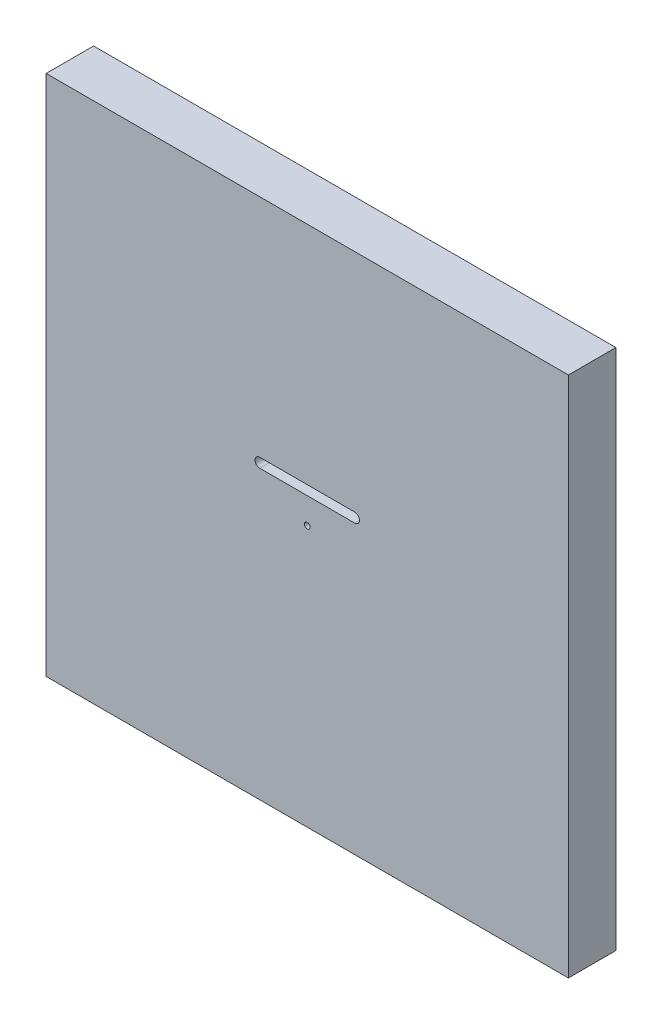
ISO-10303-21;
HEADER;
FILE_DESCRIPTION(('STEP AP214'),'2;1');
FILE_NAME('part.step','',(''),(''),'','','');
FILE_SCHEMA(('AUTOMOTIVE_DESIGN { 1 0 10303 214 1 1 1 1 }'));
ENDSEC;
DATA;
#1=APPLICATION_CONTEXT('core data for automotive mechanical design processes');
#2=APPLICATION_PROTOCOL_DEFINITION('international standard','automotive_design',2000,#1);
#3=PRODUCT_CONTEXT('',#1,'mechanical');
#4=PRODUCT('Part','Part','',(#3));
#5=PRODUCT_RELATED_PRODUCT_CATEGORY('part','',(#4));
#6=PRODUCT_DEFINITION_FORMATION('','',#4);
#7=PRODUCT_DEFINITION_CONTEXT('part definition',#1,'design');
#8=PRODUCT_DEFINITION('design','',#6,#7);
#9=PRODUCT_DEFINITION_SHAPE('','',#8);
#10=(LENGTH_UNIT() NAMED_UNIT(*) SI_UNIT(.MILLI.,.METRE.));
#11=(NAMED_UNIT(*) PLANE_ANGLE_UNIT() SI_UNIT($,.RADIAN.));
#12=(NAMED_UNIT(*) SI_UNIT($,.STERADIAN.) SOLID_ANGLE_UNIT());
#13=UNCERTAINTY_MEASURE_WITH_UNIT(LENGTH_MEASURE(1.E-05),#10,'distance_accuracy_value','');
#14=(GEOMETRIC_REPRESENTATION_CONTEXT(3) GLOBAL_UNCERTAINTY_ASSIGNED_CONTEXT((#13)) GLOBAL_UNIT_ASSIGNED_CONTEXT((#10,
#11,#12)) REPRESENTATION_CONTEXT('',''));
#15=CARTESIAN_POINT('',(0.,0.,0.));
#16=DIRECTION('',(0.,0.,1.));
#17=DIRECTION('',(1.,0.,0.));
#18=AXIS2_PLACEMENT_3D('',#15,#16,#17);
#19=CARTESIAN_POINT('',(-234.011279982949,178.585657370518,50.));
#20=DIRECTION('',(1.,0.,0.));
#21=DIRECTION('',(0.,1.,0.));
#22=AXIS2_PLACEMENT_3D('',#19,#20,#21);
#23=PLANE('',#22);
#24=DIRECTION('',(0.,-1.,0.));
#25=VECTOR('',#24,1.);
#26=CARTESIAN_POINT('',(-234.011279982949,178.585657370518,0.));
#27=LINE('',#26,#25);
#28=CARTESIAN_POINT('',(-234.011279982949,178.585657370518,0.));
#29=VERTEX_POINT('',#28);
#30=CARTESIAN_POINT('',(-234.011279982949,-371.414342629482,0.));
#31=VERTEX_POINT('',#30);
#32=EDGE_CURVE('E131',#29,#31,#27,.T.);
#33=ORIENTED_EDGE('',*,*,#32,.T.);
#34=DIRECTION('',(0.,0.,-1.));
#35=VECTOR('',#34,1.);
#36=CARTESIAN_POINT('',(-234.011279982949,-371.414342629482,50.));
#37=LINE('',#36,#35);
#38=CARTESIAN_POINT('',(-234.011279982949,-371.414342629482,50.));
#39=VERTEX_POINT('',#38);
#40=EDGE_CURVE('E11',#39,#31,#37,.T.);
#41=ORIENTED_EDGE('',*,*,#40,.F.);
#42=DIRECTION('',(0.,-1.,0.));
#43=VECTOR('',#42,1.);
#44=CARTESIAN_POINT('',(-234.011279982949,178.585657370518,50.));
#45=LINE('',#44,#43);
#46=CARTESIAN_POINT('',(-234.011279982949,178.585657370518,50.));
#47=VERTEX_POINT('',#46);
#48=EDGE_CURVE('E140',#47,#39,#45,.T.);
#49=ORIENTED_EDGE('',*,*,#48,.F.);
#50=DIRECTION('',(0.,0.,-1.));
#51=VECTOR('',#50,1.);
#52=CARTESIAN_POINT('',(-234.011279982949,178.585657370518,50.));
#53=LINE('',#52,#51);
#54=EDGE_CURVE('E150',#47,#29,#53,.T.);
#55=ORIENTED_EDGE('',*,*,#54,.T.);
#56=EDGE_LOOP('',(#33,#41,#49,#55));
#57=FACE_BOUND('',#56,.T.);
#58=ADVANCED_FACE('F33',(#57),#23,.F.);
#59=CARTESIAN_POINT('',(-234.011279982949,-371.414342629482,50.));
#60=DIRECTION('',(0.,1.,0.));
#61=DIRECTION('',(0.,0.,1.));
#62=AXIS2_PLACEMENT_3D('',#59,#60,#61);
#63=PLANE('',#62);
#64=DIRECTION('',(1.,0.,0.));
#65=VECTOR('',#64,1.);
#66=CARTESIAN_POINT('',(-234.011279982949,-371.414342629482,0.));
#67=LINE('',#66,#65);
#68=CARTESIAN_POINT('',(315.988720017051,-371.414342629482,0.));
#69=VERTEX_POINT('',#68);
#70=EDGE_CURVE('E153',#31,#69,#67,.T.);
#71=ORIENTED_EDGE('',*,*,#70,.T.);
#72=DIRECTION('',(0.,0.,-1.));
#73=VECTOR('',#72,1.);
#74=CARTESIAN_POINT('',(315.988720017051,-371.414342629482,50.));
#75=LINE('',#74,#73);
#76=CARTESIAN_POINT('',(315.988720017051,-371.414342629482,50.));
#77=VERTEX_POINT('',#76);
#78=EDGE_CURVE('E40',#77,#69,#75,.T.);
#79=ORIENTED_EDGE('',*,*,#78,.F.);
#80=DIRECTION('',(1.,0.,0.));
#81=VECTOR('',#80,1.);
#82=CARTESIAN_POINT('',(-234.011279982949,-371.414342629482,50.));
#83=LINE('',#82,#81);
#84=EDGE_CURVE('E143',#39,#77,#83,.T.);
#85=ORIENTED_EDGE('',*,*,#84,.F.);
#86=ORIENTED_EDGE('',*,*,#40,.T.);
#87=EDGE_LOOP('',(#71,#79,#85,#86));
#88=FACE_BOUND('',#87,.T.);
#89=ADVANCED_FACE('F182',(#88),#63,.F.);
#90=CARTESIAN_POINT('',(315.988720017051,178.585657370518,50.));
#91=DIRECTION('',(-1.,0.,0.));
#92=DIRECTION('',(0.,-1.,0.));
#93=AXIS2_PLACEMENT_3D('',#90,#91,#92);
#94=PLANE('',#93);
#95=DIRECTION('',(0.,1.,0.));
#96=VECTOR('',#95,1.);
#97=CARTESIAN_POINT('',(315.988720017051,178.585657370518,0.));
#98=LINE('',#97,#96);
#99=CARTESIAN_POINT('',(315.988720017051,178.585657370518,0.));
#100=VERTEX_POINT('',#99);
#101=EDGE_CURVE('E155',#69,#100,#98,.T.);
#102=ORIENTED_EDGE('',*,*,#101,.T.);
#103=DIRECTION('',(0.,0.,-1.));
#104=VECTOR('',#103,1.);
#105=CARTESIAN_POINT('',(315.988720017051,178.585657370518,50.));
#106=LINE('',#105,#104);
#107=CARTESIAN_POINT('',(315.988720017051,178.585657370518,50.));
#108=VERTEX_POINT('',#107);
#109=EDGE_CURVE('E160',#108,#100,#106,.T.);
#110=ORIENTED_EDGE('',*,*,#109,.F.);
#111=DIRECTION('',(0.,1.,0.));
#112=VECTOR('',#111,1.);
#113=CARTESIAN_POINT('',(315.988720017051,178.585657370518,50.));
#114=LINE('',#113,#112);
#115=EDGE_CURVE('E146',#77,#108,#114,.T.);
#116=ORIENTED_EDGE('',*,*,#115,.F.);
#117=ORIENTED_EDGE('',*,*,#78,.T.);
#118=EDGE_LOOP('',(#102,#110,#116,#117));
#119=FACE_BOUND('',#118,.T.);
#120=ADVANCED_FACE('F167',(#119),#94,.F.);
#121=CARTESIAN_POINT('',(-234.011279982949,178.585657370518,50.));
#122=DIRECTION('',(0.,-1.,0.));
#123=DIRECTION('',(0.,0.,-1.));
#124=AXIS2_PLACEMENT_3D('',#121,#122,#123);
#125=PLANE('',#124);
#126=DIRECTION('',(-1.,0.,0.));
#127=VECTOR('',#126,1.);
#128=CARTESIAN_POINT('',(-234.011279982949,178.585657370518,0.));
#129=LINE('',#128,#127);
#130=EDGE_CURVE('E144',#100,#29,#129,.T.);
#131=ORIENTED_EDGE('',*,*,#130,.T.);
#132=ORIENTED_EDGE('',*,*,#54,.F.);
#133=DIRECTION('',(-1.,0.,0.));
#134=VECTOR('',#133,1.);
#135=CARTESIAN_POINT('',(-234.011279982949,178.585657370518,50.));
#136=LINE('',#135,#134);
#137=EDGE_CURVE('E148',#108,#47,#136,.T.);
#138=ORIENTED_EDGE('',*,*,#137,.F.);
#139=ORIENTED_EDGE('',*,*,#109,.T.);
#140=EDGE_LOOP('',(#131,#132,#138,#139));
#141=FACE_BOUND('',#140,.T.);
#142=ADVANCED_FACE('F176',(#141),#125,.F.);
#143=CARTESIAN_POINT('',(0.,0.,50.));
#144=DIRECTION('',(0.,0.,1.));
#145=DIRECTION('',(1.,0.,0.));
#146=AXIS2_PLACEMENT_3D('',#143,#144,#145);
#147=PLANE('',#146);
#148=CARTESIAN_POINT('',(90.988720017051,-63.9995143088089,50.));
#149=DIRECTION('',(0.,0.,-1.));
#150=DIRECTION('',(1.,0.,0.));
#151=AXIS2_PLACEMENT_3D('',#148,#149,#150);
#152=CIRCLE('',#151,5.);
#153=CARTESIAN_POINT('',(90.988720017051,-58.9995143088089,50.));
#154=VERTEX_POINT('',#153);
#155=CARTESIAN_POINT('',(90.988720017051,-68.9995143088089,50.));
#156=VERTEX_POINT('',#155);
#157=EDGE_CURVE('E99',#154,#156,#152,.T.);
#158=ORIENTED_EDGE('',*,*,#157,.T.);
#159=DIRECTION('',(-1.,0.,0.));
#160=VECTOR('',#159,1.);
#161=CARTESIAN_POINT('',(90.988720017051,-68.9995143088089,50.));
#162=LINE('',#161,#160);
#163=CARTESIAN_POINT('',(-9.01127998294896,-68.9995143088089,50.));
#164=VERTEX_POINT('',#163);
#165=EDGE_CURVE('E108',#156,#164,#162,.T.);
#166=ORIENTED_EDGE('',*,*,#165,.T.);
#167=CARTESIAN_POINT('',(-9.01127998294897,-63.9995143088089,50.));
#168=DIRECTION('',(0.,0.,-1.));
#169=DIRECTION('',(-1.,0.,0.));
#170=AXIS2_PLACEMENT_3D('',#167,#168,#169);
#171=CIRCLE('',#170,5.);
#172=CARTESIAN_POINT('',(-9.01127998294897,-58.9995143088089,50.));
#173=VERTEX_POINT('',#172);
#174=EDGE_CURVE('E47',#164,#173,#171,.T.);
#175=ORIENTED_EDGE('',*,*,#174,.T.);
#176=DIRECTION('',(1.,0.,0.));
#177=VECTOR('',#176,1.);
#178=CARTESIAN_POINT('',(90.988720017051,-58.9995143088089,50.));
#179=LINE('',#178,#177);
#180=EDGE_CURVE('E105',#173,#154,#179,.T.);
#181=ORIENTED_EDGE('',*,*,#180,.T.);
#182=EDGE_LOOP('',(#158,#166,#175,#181));
#183=FACE_BOUND('',#182,.T.);
#184=CARTESIAN_POINT('',(40.988720017051,-96.414342629482,50.));
#185=DIRECTION('',(0.,0.,-1.));
#186=DIRECTION('',(-1.,0.,0.));
#187=AXIS2_PLACEMENT_3D('',#184,#185,#186);
#188=CIRCLE('',#187,3.);
#189=CARTESIAN_POINT('',(37.988720017051,-96.414342629482,50.));
#190=VERTEX_POINT('',#189);
#191=EDGE_CURVE('E125',#190,#190,#188,.T.);
#192=ORIENTED_EDGE('',*,*,#191,.T.);
#193=EDGE_LOOP('',(#192));
#194=FACE_BOUND('',#193,.T.);
#195=ORIENTED_EDGE('',*,*,#48,.T.);
#196=ORIENTED_EDGE('',*,*,#84,.T.);
#197=ORIENTED_EDGE('',*,*,#115,.T.);
#198=ORIENTED_EDGE('',*,*,#137,.T.);
#199=EDGE_LOOP('',(#195,#196,#197,#198));
#200=FACE_BOUND('',#199,.T.);
#201=ADVANCED_FACE('F112',(#183,#194,#200),#147,.T.);
#202=CARTESIAN_POINT('',(0.,0.,0.));
#203=DIRECTION('',(0.,0.,1.));
#204=DIRECTION('',(1.,0.,0.));
#205=AXIS2_PLACEMENT_3D('',#202,#203,#204);
#206=PLANE('',#205);
#207=DIRECTION('',(-1.,0.,0.));
#208=VECTOR('',#207,1.);
#209=CARTESIAN_POINT('',(90.988720017051,-68.9995143088089,0.));
#210=LINE('',#209,#208);
#211=CARTESIAN_POINT('',(90.988720017051,-68.9995143088089,0.));
#212=VERTEX_POINT('',#211);
#213=CARTESIAN_POINT('',(-9.01127998294896,-68.9995143088089,0.));
#214=VERTEX_POINT('',#213);
#215=EDGE_CURVE('E124',#212,#214,#210,.T.);
#216=ORIENTED_EDGE('',*,*,#215,.F.);
#217=CARTESIAN_POINT('',(90.988720017051,-63.9995143088089,0.));
#218=DIRECTION('',(0.,0.,-1.));
#219=DIRECTION('',(1.,0.,0.));
#220=AXIS2_PLACEMENT_3D('',#217,#218,#219);
#221=CIRCLE('',#220,5.);
#222=CARTESIAN_POINT('',(90.988720017051,-58.9995143088089,0.));
#223=VERTEX_POINT('',#222);
#224=EDGE_CURVE('E55',#223,#212,#221,.T.);
#225=ORIENTED_EDGE('',*,*,#224,.F.);
#226=DIRECTION('',(1.,0.,0.));
#227=VECTOR('',#226,1.);
#228=CARTESIAN_POINT('',(90.988720017051,-58.9995143088089,0.));
#229=LINE('',#228,#227);
#230=CARTESIAN_POINT('',(-9.01127998294897,-58.9995143088089,0.));
#231=VERTEX_POINT('',#230);
#232=EDGE_CURVE('E115',#231,#223,#229,.T.);
#233=ORIENTED_EDGE('',*,*,#232,.F.);
#234=CARTESIAN_POINT('',(-9.01127998294897,-63.9995143088089,0.));
#235=DIRECTION('',(0.,0.,-1.));
#236=DIRECTION('',(-1.,0.,0.));
#237=AXIS2_PLACEMENT_3D('',#234,#235,#236);
#238=CIRCLE('',#237,5.);
#239=EDGE_CURVE('E118',#214,#231,#238,.T.);
#240=ORIENTED_EDGE('',*,*,#239,.F.);
#241=EDGE_LOOP('',(#216,#225,#233,#240));
#242=FACE_BOUND('',#241,.T.);
#243=CARTESIAN_POINT('',(40.988720017051,-96.414342629482,0.));
#244=DIRECTION('',(0.,0.,-1.));
#245=DIRECTION('',(-1.,0.,0.));
#246=AXIS2_PLACEMENT_3D('',#243,#244,#245);
#247=CIRCLE('',#246,3.);
#248=CARTESIAN_POINT('',(37.988720017051,-96.414342629482,0.));
#249=VERTEX_POINT('',#248);
#250=EDGE_CURVE('E137',#249,#249,#247,.T.);
#251=ORIENTED_EDGE('',*,*,#250,.F.);
#252=EDGE_LOOP('',(#251));
#253=FACE_BOUND('',#252,.T.);
#254=ORIENTED_EDGE('',*,*,#32,.F.);
#255=ORIENTED_EDGE('',*,*,#130,.F.);
#256=ORIENTED_EDGE('',*,*,#101,.F.);
#257=ORIENTED_EDGE('',*,*,#70,.F.);
#258=EDGE_LOOP('',(#254,#255,#256,#257));
#259=FACE_BOUND('',#258,.T.);
#260=ADVANCED_FACE('F173',(#242,#253,#259),#206,.F.);
#261=CARTESIAN_POINT('',(40.988720017051,-96.414342629482,50.));
#262=DIRECTION('',(0.,0.,-1.));
#263=DIRECTION('',(-1.,0.,0.));
#264=AXIS2_PLACEMENT_3D('',#261,#262,#263);
#265=CYLINDRICAL_SURFACE('',#264,3.);
#266=ORIENTED_EDGE('',*,*,#191,.F.);
#267=EDGE_LOOP('',(#266));
#268=FACE_BOUND('',#267,.T.);
#269=ORIENTED_EDGE('',*,*,#250,.T.);
#270=EDGE_LOOP('',(#269));
#271=FACE_BOUND('',#270,.T.);
#272=ADVANCED_FACE('F194',(#268,#271),#265,.F.);
#273=CARTESIAN_POINT('',(90.988720017051,-63.9995143088089,50.));
#274=DIRECTION('',(0.,0.,-1.));
#275=DIRECTION('',(-1.,0.,0.));
#276=AXIS2_PLACEMENT_3D('',#273,#274,#275);
#277=CYLINDRICAL_SURFACE('',#276,5.);
#278=ORIENTED_EDGE('',*,*,#224,.T.);
#279=DIRECTION('',(0.,0.,-1.));
#280=VECTOR('',#279,1.);
#281=CARTESIAN_POINT('',(90.988720017051,-68.9995143088089,50.));
#282=LINE('',#281,#280);
#283=EDGE_CURVE('E95',#156,#212,#282,.T.);
#284=ORIENTED_EDGE('',*,*,#283,.F.);
#285=ORIENTED_EDGE('',*,*,#157,.F.);
#286=DIRECTION('',(0.,0.,-1.));
#287=VECTOR('',#286,1.);
#288=CARTESIAN_POINT('',(90.988720017051,-58.9995143088089,50.));
#289=LINE('',#288,#287);
#290=EDGE_CURVE('E129',#154,#223,#289,.T.);
#291=ORIENTED_EDGE('',*,*,#290,.T.);
#292=EDGE_LOOP('',(#278,#284,#285,#291));
#293=FACE_BOUND('',#292,.T.);
#294=ADVANCED_FACE('F97',(#293),#277,.F.);
#295=CARTESIAN_POINT('',(90.988720017051,-58.9995143088089,50.));
#296=DIRECTION('',(0.,1.,0.));
#297=DIRECTION('',(0.,0.,1.));
#298=AXIS2_PLACEMENT_3D('',#295,#296,#297);
#299=PLANE('',#298);
#300=ORIENTED_EDGE('',*,*,#232,.T.);
#301=ORIENTED_EDGE('',*,*,#290,.F.);
#302=ORIENTED_EDGE('',*,*,#180,.F.);
#303=DIRECTION('',(0.,0.,-1.));
#304=VECTOR('',#303,1.);
#305=CARTESIAN_POINT('',(-9.01127998294897,-58.9995143088089,50.));
#306=LINE('',#305,#304);
#307=EDGE_CURVE('E132',#173,#231,#306,.T.);
#308=ORIENTED_EDGE('',*,*,#307,.T.);
#309=EDGE_LOOP('',(#300,#301,#302,#308));
#310=FACE_BOUND('',#309,.T.);
#311=ADVANCED_FACE('F203',(#310),#299,.F.);
#312=CARTESIAN_POINT('',(-9.01127998294897,-63.9995143088089,50.));
#313=DIRECTION('',(0.,0.,-1.));
#314=DIRECTION('',(-1.,0.,0.));
#315=AXIS2_PLACEMENT_3D('',#312,#313,#314);
#316=CYLINDRICAL_SURFACE('',#315,5.);
#317=ORIENTED_EDGE('',*,*,#239,.T.);
#318=ORIENTED_EDGE('',*,*,#307,.F.);
#319=ORIENTED_EDGE('',*,*,#174,.F.);
#320=DIRECTION('',(0.,0.,-1.));
#321=VECTOR('',#320,1.);
#322=CARTESIAN_POINT('',(-9.01127998294896,-68.9995143088089,50.));
#323=LINE('',#322,#321);
#324=EDGE_CURVE('E104',#164,#214,#323,.T.);
#325=ORIENTED_EDGE('',*,*,#324,.T.);
#326=EDGE_LOOP('',(#317,#318,#319,#325));
#327=FACE_BOUND('',#326,.T.);
#328=ADVANCED_FACE('F206',(#327),#316,.F.);
#329=CARTESIAN_POINT('',(90.988720017051,-68.9995143088089,50.));
#330=DIRECTION('',(0.,-1.,0.));
#331=DIRECTION('',(0.,0.,-1.));
#332=AXIS2_PLACEMENT_3D('',#329,#330,#331);
#333=PLANE('',#332);
#334=ORIENTED_EDGE('',*,*,#215,.T.);
#335=ORIENTED_EDGE('',*,*,#324,.F.);
#336=ORIENTED_EDGE('',*,*,#165,.F.);
#337=ORIENTED_EDGE('',*,*,#283,.T.);
#338=EDGE_LOOP('',(#334,#335,#336,#337));
#339=FACE_BOUND('',#338,.T.);
#340=ADVANCED_FACE('F109',(#339),#333,.F.);
#341=CLOSED_SHELL('',(#58,#89,#120,#142,#201,#260,#272,#294,#311,#328,#340));
#342=MANIFOLD_SOLID_BREP('B2',#341);
#343=ADVANCED_BREP_SHAPE_REPRESENTATION('',(#18,#342),#14);
#344=SHAPE_DEFINITION_REPRESENTATION(#9,#343);
ENDSEC;
END-ISO-10303-21;
